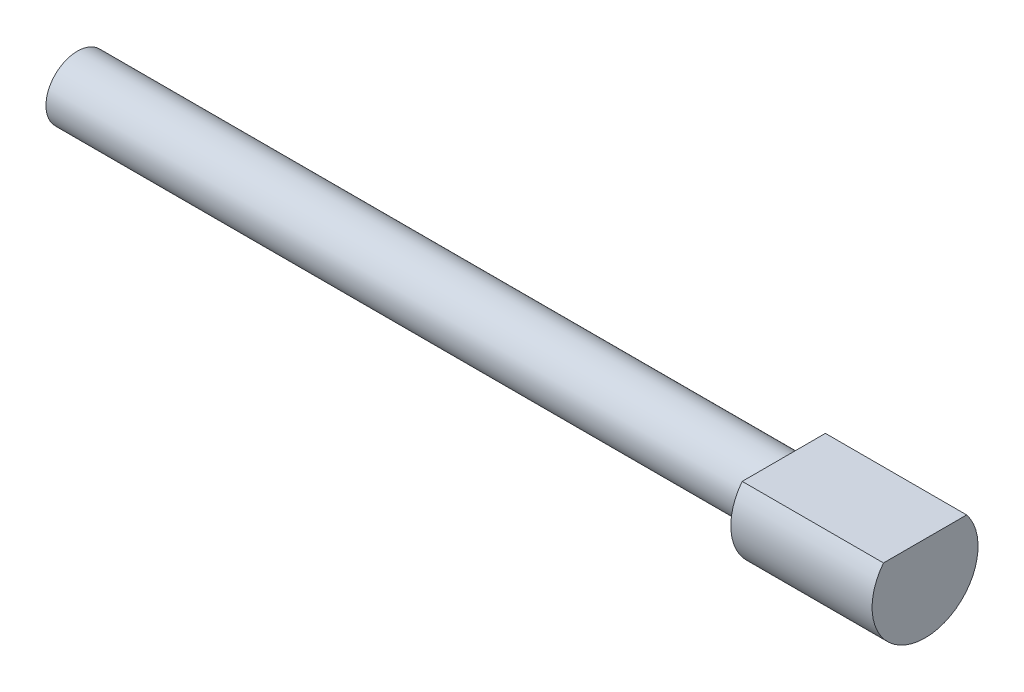
ISO-10303-21;
HEADER;
FILE_DESCRIPTION(('STEP AP214'),'2;1');
FILE_NAME('part.step','',(''),(''),'','','');
FILE_SCHEMA(('AUTOMOTIVE_DESIGN { 1 0 10303 214 1 1 1 1 }'));
ENDSEC;
DATA;
#1=APPLICATION_CONTEXT('core data for automotive mechanical design processes');
#2=APPLICATION_PROTOCOL_DEFINITION('international standard','automotive_design',2000,#1);
#3=PRODUCT_CONTEXT('',#1,'mechanical');
#4=PRODUCT('Part','Part','',(#3));
#5=PRODUCT_RELATED_PRODUCT_CATEGORY('part','',(#4));
#6=PRODUCT_DEFINITION_FORMATION('','',#4);
#7=PRODUCT_DEFINITION_CONTEXT('part definition',#1,'design');
#8=PRODUCT_DEFINITION('design','',#6,#7);
#9=PRODUCT_DEFINITION_SHAPE('','',#8);
#10=(LENGTH_UNIT() NAMED_UNIT(*) SI_UNIT(.MILLI.,.METRE.));
#11=(NAMED_UNIT(*) PLANE_ANGLE_UNIT() SI_UNIT($,.RADIAN.));
#12=(NAMED_UNIT(*) SI_UNIT($,.STERADIAN.) SOLID_ANGLE_UNIT());
#13=UNCERTAINTY_MEASURE_WITH_UNIT(LENGTH_MEASURE(1.E-05),#10,'distance_accuracy_value','');
#14=(GEOMETRIC_REPRESENTATION_CONTEXT(3) GLOBAL_UNCERTAINTY_ASSIGNED_CONTEXT((#13)) GLOBAL_UNIT_ASSIGNED_CONTEXT((#10,
#11,#12)) REPRESENTATION_CONTEXT('',''));
#15=CARTESIAN_POINT('',(0.,0.,0.));
#16=DIRECTION('',(0.,0.,1.));
#17=DIRECTION('',(1.,0.,0.));
#18=AXIS2_PLACEMENT_3D('',#15,#16,#17);
#19=CARTESIAN_POINT('',(-25.4000000000001,0.,1.94289029309402E-13));
#20=DIRECTION('',(1.,0.,0.));
#21=DIRECTION('',(0.,0.,-1.00000000000001));
#22=AXIS2_PLACEMENT_3D('',#19,#20,#21);
#23=CYLINDRICAL_SURFACE('',#22,1.1303);
#24=CARTESIAN_POINT('',(-25.4000000000001,0.,1.94289029309402E-13));
#25=DIRECTION('',(1.,0.,0.));
#26=DIRECTION('',(0.,0.,-1.00000000000001));
#27=AXIS2_PLACEMENT_3D('',#24,#25,#26);
#28=CIRCLE('',#27,1.1303);
#29=CARTESIAN_POINT('',(-25.4000000000001,0.,-1.13029999999982));
#30=VERTEX_POINT('',#29);
#31=EDGE_CURVE('E12',#30,#30,#28,.T.);
#32=ORIENTED_EDGE('',*,*,#31,.T.);
#33=EDGE_LOOP('',(#32));
#34=FACE_BOUND('',#33,.T.);
#35=CARTESIAN_POINT('',(0.,0.,0.));
#36=DIRECTION('',(1.,0.,0.));
#37=DIRECTION('',(0.,0.,-1.00000000000001));
#38=AXIS2_PLACEMENT_3D('',#35,#36,#37);
#39=CIRCLE('',#38,1.1303);
#40=CARTESIAN_POINT('',(0.,0.,-1.13030000000001));
#41=VERTEX_POINT('',#40);
#42=EDGE_CURVE('E43',#41,#41,#39,.T.);
#43=ORIENTED_EDGE('',*,*,#42,.F.);
#44=EDGE_LOOP('',(#43));
#45=FACE_BOUND('',#44,.T.);
#46=ADVANCED_FACE('F40',(#34,#45),#23,.T.);
#47=CARTESIAN_POINT('',(-25.4000000000001,0.,1.94289029309402E-13));
#48=DIRECTION('',(1.,0.,0.));
#49=DIRECTION('',(0.,0.,-1.00000000000001));
#50=AXIS2_PLACEMENT_3D('',#47,#48,#49);
#51=PLANE('',#50);
#52=ORIENTED_EDGE('',*,*,#31,.F.);
#53=EDGE_LOOP('',(#52));
#54=FACE_BOUND('',#53,.T.);
#55=ADVANCED_FACE('F97',(#54),#51,.F.);
#56=CARTESIAN_POINT('',(5.0800000000001,0.,0.));
#57=DIRECTION('',(-1.,0.,0.));
#58=DIRECTION('',(0.,0.,1.00000000000001));
#59=AXIS2_PLACEMENT_3D('',#56,#57,#58);
#60=CYLINDRICAL_SURFACE('',#59,1.905);
#61=CARTESIAN_POINT('',(5.0800000000001,0.,0.));
#62=DIRECTION('',(1.,0.,0.));
#63=DIRECTION('',(0.,0.,-1.00000000000001));
#64=AXIS2_PLACEMENT_3D('',#61,#62,#63);
#65=CIRCLE('',#64,1.905);
#66=CARTESIAN_POINT('',(5.08,1.18021345994819,1.49536657343841));
#67=VERTEX_POINT('',#66);
#68=CARTESIAN_POINT('',(5.08000000000004,1.1802134599482,-1.49536657343828));
#69=VERTEX_POINT('',#68);
#70=EDGE_CURVE('E75',#67,#69,#65,.T.);
#71=ORIENTED_EDGE('',*,*,#70,.F.);
#72=DIRECTION('',(1.,0.,0.));
#73=VECTOR('',#72,1.);
#74=CARTESIAN_POINT('',(-1.66533453693773E-13,1.18021345994794,1.49536657343848));
#75=LINE('',#74,#73);
#76=CARTESIAN_POINT('',(-1.66533453693773E-13,1.18021345994794,1.49536657343848));
#77=VERTEX_POINT('',#76);
#78=EDGE_CURVE('E63',#77,#67,#75,.T.);
#79=ORIENTED_EDGE('',*,*,#78,.F.);
#80=CARTESIAN_POINT('',(0.,0.,0.));
#81=DIRECTION('',(1.,0.,0.));
#82=DIRECTION('',(0.,0.,-1.00000000000001));
#83=AXIS2_PLACEMENT_3D('',#80,#81,#82);
#84=CIRCLE('',#83,1.905);
#85=CARTESIAN_POINT('',(0.,1.1802134599483,-1.49536657343827));
#86=VERTEX_POINT('',#85);
#87=EDGE_CURVE('E78',#77,#86,#84,.T.);
#88=ORIENTED_EDGE('',*,*,#87,.T.);
#89=DIRECTION('',(1.,0.,0.));
#90=VECTOR('',#89,1.);
#91=CARTESIAN_POINT('',(0.,1.1802134599483,-1.49536657343827));
#92=LINE('',#91,#90);
#93=EDGE_CURVE('E54',#86,#69,#92,.T.);
#94=ORIENTED_EDGE('',*,*,#93,.T.);
#95=EDGE_LOOP('',(#71,#79,#88,#94));
#96=FACE_BOUND('',#95,.T.);
#97=ADVANCED_FACE('F77',(#96),#60,.T.);
#98=CARTESIAN_POINT('',(5.0800000000001,0.,0.));
#99=DIRECTION('',(1.,0.,0.));
#100=DIRECTION('',(0.,0.,-1.00000000000001));
#101=AXIS2_PLACEMENT_3D('',#98,#99,#100);
#102=PLANE('',#101);
#103=DIRECTION('',(0.,0.,-1.00000000000001));
#104=VECTOR('',#103,1.);
#105=CARTESIAN_POINT('',(5.0800000000001,1.1802134599482,0.));
#106=LINE('',#105,#104);
#107=EDGE_CURVE('E66',#67,#69,#106,.T.);
#108=ORIENTED_EDGE('',*,*,#107,.F.);
#109=ORIENTED_EDGE('',*,*,#70,.T.);
#110=EDGE_LOOP('',(#108,#109));
#111=FACE_BOUND('',#110,.T.);
#112=ADVANCED_FACE('F74',(#111),#102,.T.);
#113=CARTESIAN_POINT('',(0.,0.,0.));
#114=DIRECTION('',(1.,0.,0.));
#115=DIRECTION('',(0.,0.,-1.00000000000001));
#116=AXIS2_PLACEMENT_3D('',#113,#114,#115);
#117=PLANE('',#116);
#118=ORIENTED_EDGE('',*,*,#42,.T.);
#119=EDGE_LOOP('',(#118));
#120=FACE_BOUND('',#119,.T.);
#121=ORIENTED_EDGE('',*,*,#87,.F.);
#122=DIRECTION('',(0.,0.,-1.00000000000001));
#123=VECTOR('',#122,1.);
#124=CARTESIAN_POINT('',(0.,1.1802134599483,0.));
#125=LINE('',#124,#123);
#126=EDGE_CURVE('E59',#77,#86,#125,.T.);
#127=ORIENTED_EDGE('',*,*,#126,.T.);
#128=EDGE_LOOP('',(#121,#127));
#129=FACE_BOUND('',#128,.T.);
#130=ADVANCED_FACE('F85',(#120,#129),#117,.F.);
#131=CARTESIAN_POINT('',(0.,1.1802134599483,0.));
#132=DIRECTION('',(0.,-1.,0.));
#133=DIRECTION('',(0.,0.,-1.00000000000001));
#134=AXIS2_PLACEMENT_3D('',#131,#132,#133);
#135=PLANE('',#134);
#136=ORIENTED_EDGE('',*,*,#107,.T.);
#137=ORIENTED_EDGE('',*,*,#93,.F.);
#138=ORIENTED_EDGE('',*,*,#126,.F.);
#139=ORIENTED_EDGE('',*,*,#78,.T.);
#140=EDGE_LOOP('',(#136,#137,#138,#139));
#141=FACE_BOUND('',#140,.T.);
#142=ADVANCED_FACE('F65',(#141),#135,.F.);
#143=CLOSED_SHELL('',(#46,#55,#97,#112,#130,#142));
#144=MANIFOLD_SOLID_BREP('B2',#143);
#145=ADVANCED_BREP_SHAPE_REPRESENTATION('',(#18,#144),#14);
#146=SHAPE_DEFINITION_REPRESENTATION(#9,#145);
ENDSEC;
END-ISO-10303-21;
